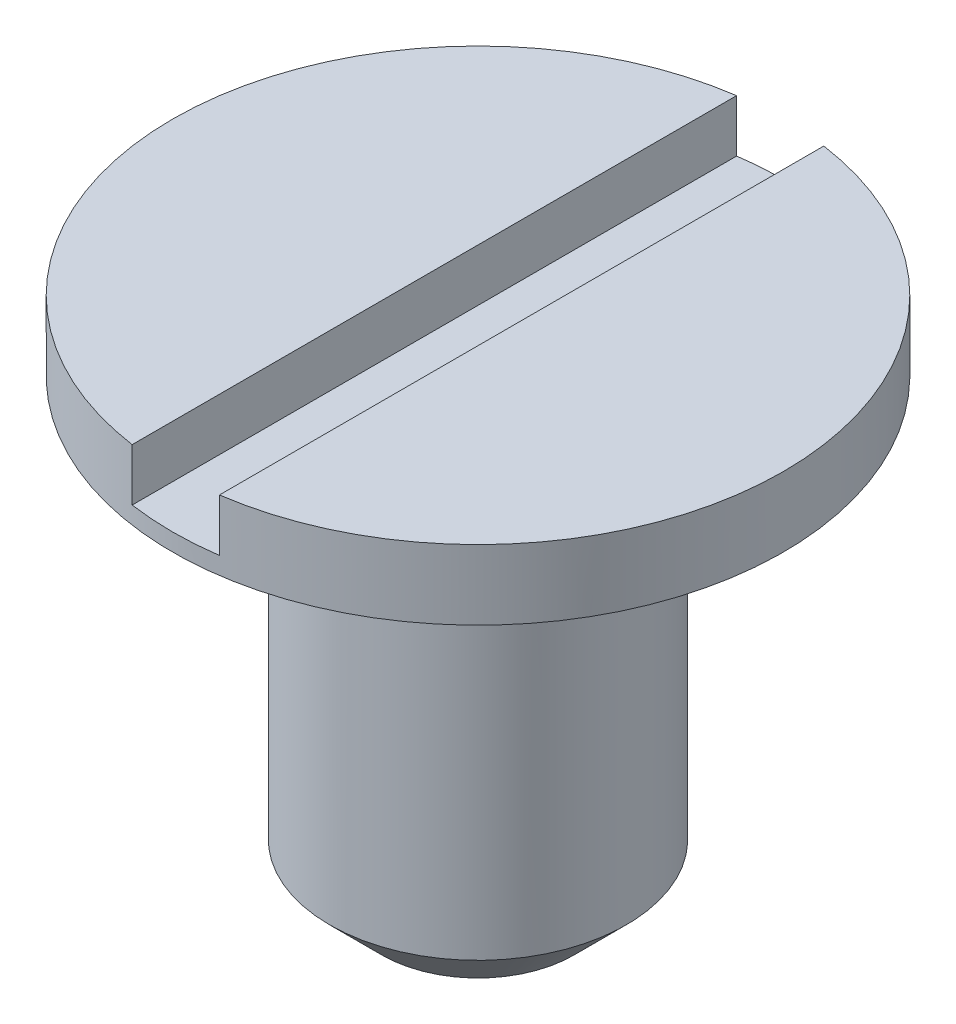
ISO-10303-21;
HEADER;
FILE_DESCRIPTION(('STEP AP214'),'2;1');
FILE_NAME('part.step','',(''),(''),'','','');
FILE_SCHEMA(('AUTOMOTIVE_DESIGN { 1 0 10303 214 1 1 1 1 }'));
ENDSEC;
DATA;
#1=APPLICATION_CONTEXT('core data for automotive mechanical design processes');
#2=APPLICATION_PROTOCOL_DEFINITION('international standard','automotive_design',2000,#1);
#3=PRODUCT_CONTEXT('',#1,'mechanical');
#4=PRODUCT('Part','Part','',(#3));
#5=PRODUCT_RELATED_PRODUCT_CATEGORY('part','',(#4));
#6=PRODUCT_DEFINITION_FORMATION('','',#4);
#7=PRODUCT_DEFINITION_CONTEXT('part definition',#1,'design');
#8=PRODUCT_DEFINITION('design','',#6,#7);
#9=PRODUCT_DEFINITION_SHAPE('','',#8);
#10=(LENGTH_UNIT() NAMED_UNIT(*) SI_UNIT(.MILLI.,.METRE.));
#11=(NAMED_UNIT(*) PLANE_ANGLE_UNIT() SI_UNIT($,.RADIAN.));
#12=(NAMED_UNIT(*) SI_UNIT($,.STERADIAN.) SOLID_ANGLE_UNIT());
#13=UNCERTAINTY_MEASURE_WITH_UNIT(LENGTH_MEASURE(1.E-05),#10,'distance_accuracy_value','');
#14=(GEOMETRIC_REPRESENTATION_CONTEXT(3) GLOBAL_UNCERTAINTY_ASSIGNED_CONTEXT((#13)) GLOBAL_UNIT_ASSIGNED_CONTEXT((#10,
#11,#12)) REPRESENTATION_CONTEXT('',''));
#15=CARTESIAN_POINT('',(0.,0.,0.));
#16=DIRECTION('',(0.,0.,1.));
#17=DIRECTION('',(1.,0.,0.));
#18=AXIS2_PLACEMENT_3D('',#15,#16,#17);
#19=CARTESIAN_POINT('',(0.,3.,0.));
#20=DIRECTION('',(0.,1.,0.));
#21=DIRECTION('',(0.,0.,1.));
#22=AXIS2_PLACEMENT_3D('',#19,#20,#21);
#23=PLANE('',#22);
#24=DIRECTION('',(0.,0.,-1.));
#25=VECTOR('',#24,1.);
#26=CARTESIAN_POINT('',(0.25,3.,0.));
#27=LINE('',#26,#25);
#28=CARTESIAN_POINT('',(0.25,3.,1.73205080756888));
#29=VERTEX_POINT('',#28);
#30=CARTESIAN_POINT('',(0.25,3.,-1.73205080756888));
#31=VERTEX_POINT('',#30);
#32=EDGE_CURVE('E100',#29,#31,#27,.T.);
#33=ORIENTED_EDGE('',*,*,#32,.F.);
#34=CARTESIAN_POINT('',(0.,3.,0.));
#35=DIRECTION('',(0.,1.,0.));
#36=DIRECTION('',(0.,0.,1.));
#37=AXIS2_PLACEMENT_3D('',#34,#35,#36);
#38=CIRCLE('',#37,1.75);
#39=EDGE_CURVE('E101',#29,#31,#38,.T.);
#40=ORIENTED_EDGE('',*,*,#39,.T.);
#41=EDGE_LOOP('',(#33,#40));
#42=FACE_BOUND('',#41,.T.);
#43=ADVANCED_FACE('F52',(#42),#23,.T.);
#44=CARTESIAN_POINT('',(0.,3.,0.));
#45=DIRECTION('',(0.,-1.,0.));
#46=DIRECTION('',(0.,0.,-1.));
#47=AXIS2_PLACEMENT_3D('',#44,#45,#46);
#48=CYLINDRICAL_SURFACE('',#47,1.75);
#49=ORIENTED_EDGE('',*,*,#39,.F.);
#50=DIRECTION('',(0.,-1.,0.));
#51=VECTOR('',#50,1.);
#52=CARTESIAN_POINT('',(0.25,3.,1.73205080756888));
#53=LINE('',#52,#51);
#54=CARTESIAN_POINT('',(0.25,2.7,1.73205080756888));
#55=VERTEX_POINT('',#54);
#56=EDGE_CURVE('E172',#29,#55,#53,.T.);
#57=ORIENTED_EDGE('',*,*,#56,.T.);
#58=CARTESIAN_POINT('',(0.,2.7,0.));
#59=DIRECTION('',(0.,-1.,0.));
#60=DIRECTION('',(0.,0.,-1.));
#61=AXIS2_PLACEMENT_3D('',#58,#59,#60);
#62=CIRCLE('',#61,1.75);
#63=CARTESIAN_POINT('',(-0.25,2.7,1.73205080756888));
#64=VERTEX_POINT('',#63);
#65=EDGE_CURVE('E110',#55,#64,#62,.T.);
#66=ORIENTED_EDGE('',*,*,#65,.T.);
#67=DIRECTION('',(0.,-1.,0.));
#68=VECTOR('',#67,1.);
#69=CARTESIAN_POINT('',(-0.25,3.,1.73205080756888));
#70=LINE('',#69,#68);
#71=CARTESIAN_POINT('',(-0.25,3.,1.73205080756888));
#72=VERTEX_POINT('',#71);
#73=EDGE_CURVE('E95',#64,#72,#70,.F.);
#74=ORIENTED_EDGE('',*,*,#73,.T.);
#75=CARTESIAN_POINT('',(-0.25,3.,-1.73205080756888));
#76=VERTEX_POINT('',#75);
#77=EDGE_CURVE('E108',#76,#72,#38,.T.);
#78=ORIENTED_EDGE('',*,*,#77,.F.);
#79=DIRECTION('',(0.,-1.,0.));
#80=VECTOR('',#79,1.);
#81=CARTESIAN_POINT('',(-0.25,3.,-1.73205080756888));
#82=LINE('',#81,#80);
#83=CARTESIAN_POINT('',(-0.25,2.7,-1.73205080756888));
#84=VERTEX_POINT('',#83);
#85=EDGE_CURVE('E67',#76,#84,#82,.T.);
#86=ORIENTED_EDGE('',*,*,#85,.T.);
#87=CARTESIAN_POINT('',(0.25,2.7,-1.73205080756888));
#88=VERTEX_POINT('',#87);
#89=EDGE_CURVE('E123',#84,#88,#62,.T.);
#90=ORIENTED_EDGE('',*,*,#89,.T.);
#91=DIRECTION('',(0.,-1.,0.));
#92=VECTOR('',#91,1.);
#93=CARTESIAN_POINT('',(0.25,3.,-1.73205080756888));
#94=LINE('',#93,#92);
#95=EDGE_CURVE('E75',#88,#31,#94,.F.);
#96=ORIENTED_EDGE('',*,*,#95,.T.);
#97=EDGE_LOOP('',(#49,#57,#66,#74,#78,#86,#90,#96));
#98=FACE_BOUND('',#97,.T.);
#99=CARTESIAN_POINT('',(0.,2.6,0.));
#100=DIRECTION('',(0.,-1.,0.));
#101=DIRECTION('',(0.,0.,-1.));
#102=AXIS2_PLACEMENT_3D('',#99,#100,#101);
#103=CIRCLE('',#102,1.75);
#104=CARTESIAN_POINT('',(0.,2.6,-1.75));
#105=VERTEX_POINT('',#104);
#106=EDGE_CURVE('E118',#105,#105,#103,.T.);
#107=ORIENTED_EDGE('',*,*,#106,.F.);
#108=EDGE_LOOP('',(#107));
#109=FACE_BOUND('',#108,.T.);
#110=ADVANCED_FACE('F106',(#98,#109),#48,.T.);
#111=DIRECTION('',(0.,0.,1.));
#112=VECTOR('',#111,1.);
#113=CARTESIAN_POINT('',(-0.25,3.,0.));
#114=LINE('',#113,#112);
#115=EDGE_CURVE('E92',#76,#72,#114,.T.);
#116=ORIENTED_EDGE('',*,*,#115,.F.);
#117=ORIENTED_EDGE('',*,*,#77,.T.);
#118=EDGE_LOOP('',(#116,#117));
#119=FACE_BOUND('',#118,.T.);
#120=ADVANCED_FACE('F113',(#119),#23,.T.);
#121=CARTESIAN_POINT('',(0.,0.,0.));
#122=DIRECTION('',(0.,-1.,0.));
#123=DIRECTION('',(0.,0.,-1.));
#124=AXIS2_PLACEMENT_3D('',#121,#122,#123);
#125=CYLINDRICAL_SURFACE('',#124,0.85);
#126=CARTESIAN_POINT('',(0.,0.3,0.));
#127=DIRECTION('',(0.,1.,0.));
#128=DIRECTION('',(0.,0.,1.));
#129=AXIS2_PLACEMENT_3D('',#126,#127,#128);
#130=CIRCLE('',#129,0.85);
#131=CARTESIAN_POINT('',(0.,0.3,0.85));
#132=VERTEX_POINT('',#131);
#133=EDGE_CURVE('E13',#132,#132,#130,.T.);
#134=ORIENTED_EDGE('',*,*,#133,.T.);
#135=EDGE_LOOP('',(#134));
#136=FACE_BOUND('',#135,.T.);
#137=CARTESIAN_POINT('',(0.,2.6,0.));
#138=DIRECTION('',(0.,-1.,0.));
#139=DIRECTION('',(0.,0.,-1.));
#140=AXIS2_PLACEMENT_3D('',#137,#138,#139);
#141=CIRCLE('',#140,0.85);
#142=CARTESIAN_POINT('',(0.,2.6,-0.85));
#143=VERTEX_POINT('',#142);
#144=EDGE_CURVE('E114',#143,#143,#141,.T.);
#145=ORIENTED_EDGE('',*,*,#144,.T.);
#146=EDGE_LOOP('',(#145));
#147=FACE_BOUND('',#146,.T.);
#148=ADVANCED_FACE('F148',(#136,#147),#125,.T.);
#149=CARTESIAN_POINT('',(1.75,2.6,0.));
#150=DIRECTION('',(0.,1.,0.));
#151=DIRECTION('',(0.,0.,1.));
#152=AXIS2_PLACEMENT_3D('',#149,#150,#151);
#153=PLANE('',#152);
#154=ORIENTED_EDGE('',*,*,#144,.F.);
#155=EDGE_LOOP('',(#154));
#156=FACE_BOUND('',#155,.T.);
#157=ORIENTED_EDGE('',*,*,#106,.T.);
#158=EDGE_LOOP('',(#157));
#159=FACE_BOUND('',#158,.T.);
#160=ADVANCED_FACE('F152',(#156,#159),#153,.F.);
#161=CARTESIAN_POINT('',(0.,0.,0.));
#162=DIRECTION('',(0.,1.,0.));
#163=DIRECTION('',(0.,0.,1.));
#164=AXIS2_PLACEMENT_3D('',#161,#162,#163);
#165=PLANE('',#164);
#166=CARTESIAN_POINT('',(0.,0.,0.));
#167=DIRECTION('',(0.,1.,0.));
#168=DIRECTION('',(0.,0.,1.));
#169=AXIS2_PLACEMENT_3D('',#166,#167,#168);
#170=CIRCLE('',#169,0.550000000000001);
#171=CARTESIAN_POINT('',(0.,0.,0.550000000000001));
#172=VERTEX_POINT('',#171);
#173=EDGE_CURVE('E60',#172,#172,#170,.F.);
#174=ORIENTED_EDGE('',*,*,#173,.T.);
#175=EDGE_LOOP('',(#174));
#176=FACE_BOUND('',#175,.T.);
#177=ADVANCED_FACE('F128',(#176),#165,.F.);
#178=CARTESIAN_POINT('',(0.,2.7,0.));
#179=DIRECTION('',(0.,-1.,0.));
#180=DIRECTION('',(0.,0.,-1.));
#181=AXIS2_PLACEMENT_3D('',#178,#179,#180);
#182=PLANE('',#181);
#183=DIRECTION('',(0.,0.,-1.));
#184=VECTOR('',#183,1.);
#185=CARTESIAN_POINT('',(0.25,2.7,1.85));
#186=LINE('',#185,#184);
#187=EDGE_CURVE('E169',#55,#88,#186,.T.);
#188=ORIENTED_EDGE('',*,*,#187,.T.);
#189=ORIENTED_EDGE('',*,*,#89,.F.);
#190=DIRECTION('',(0.,0.,1.));
#191=VECTOR('',#190,1.);
#192=CARTESIAN_POINT('',(-0.25,2.7,1.85));
#193=LINE('',#192,#191);
#194=EDGE_CURVE('E111',#84,#64,#193,.T.);
#195=ORIENTED_EDGE('',*,*,#194,.T.);
#196=ORIENTED_EDGE('',*,*,#65,.F.);
#197=EDGE_LOOP('',(#188,#189,#195,#196));
#198=FACE_BOUND('',#197,.T.);
#199=ADVANCED_FACE('F162',(#198),#182,.F.);
#200=CARTESIAN_POINT('',(0.25,2.7,1.85));
#201=DIRECTION('',(1.,0.,0.));
#202=DIRECTION('',(0.,0.,-1.));
#203=AXIS2_PLACEMENT_3D('',#200,#201,#202);
#204=PLANE('',#203);
#205=ORIENTED_EDGE('',*,*,#32,.T.);
#206=ORIENTED_EDGE('',*,*,#95,.F.);
#207=ORIENTED_EDGE('',*,*,#187,.F.);
#208=ORIENTED_EDGE('',*,*,#56,.F.);
#209=EDGE_LOOP('',(#205,#206,#207,#208));
#210=FACE_BOUND('',#209,.T.);
#211=ADVANCED_FACE('F135',(#210),#204,.F.);
#212=CARTESIAN_POINT('',(-0.25,2.7,1.85));
#213=DIRECTION('',(-1.,0.,0.));
#214=DIRECTION('',(0.,0.,1.));
#215=AXIS2_PLACEMENT_3D('',#212,#213,#214);
#216=PLANE('',#215);
#217=ORIENTED_EDGE('',*,*,#115,.T.);
#218=ORIENTED_EDGE('',*,*,#73,.F.);
#219=ORIENTED_EDGE('',*,*,#194,.F.);
#220=ORIENTED_EDGE('',*,*,#85,.F.);
#221=EDGE_LOOP('',(#217,#218,#219,#220));
#222=FACE_BOUND('',#221,.T.);
#223=ADVANCED_FACE('F94',(#222),#216,.F.);
#224=CARTESIAN_POINT('',(0.,0.,0.));
#225=DIRECTION('',(0.,1.,0.));
#226=DIRECTION('',(0.,0.,1.));
#227=AXIS2_PLACEMENT_3D('',#224,#225,#226);
#228=CONICAL_SURFACE('',#227,0.550000000000001,0.785398163397447);
#229=ORIENTED_EDGE('',*,*,#133,.F.);
#230=EDGE_LOOP('',(#229));
#231=FACE_BOUND('',#230,.T.);
#232=ORIENTED_EDGE('',*,*,#173,.F.);
#233=EDGE_LOOP('',(#232));
#234=FACE_BOUND('',#233,.T.);
#235=ADVANCED_FACE('F54',(#231,#234),#228,.T.);
#236=CLOSED_SHELL('',(#43,#110,#120,#148,#160,#177,#199,#211,#223,#235));
#237=MANIFOLD_SOLID_BREP('B2',#236);
#238=ADVANCED_BREP_SHAPE_REPRESENTATION('',(#18,#237),#14);
#239=SHAPE_DEFINITION_REPRESENTATION(#9,#238);
ENDSEC;
END-ISO-10303-21;
